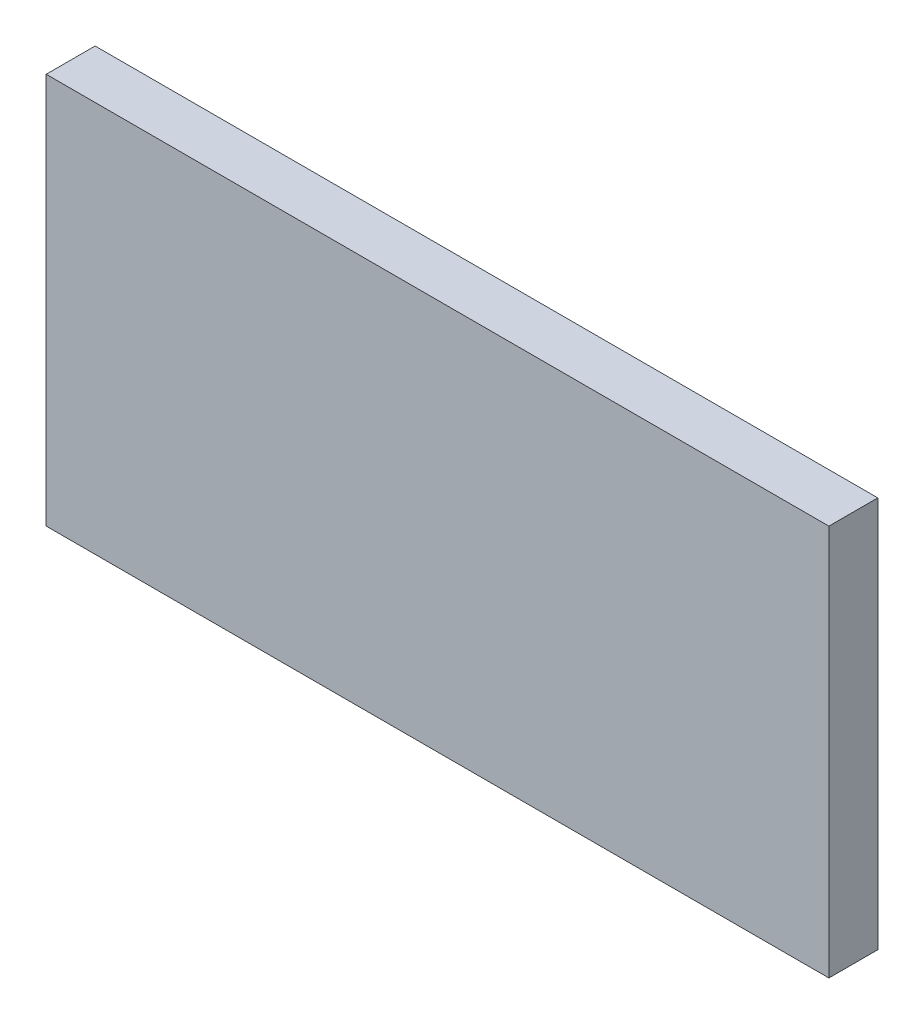
ISO-10303-21;
HEADER;
FILE_DESCRIPTION(('STEP AP214'),'2;1');
FILE_NAME('part.step','',(''),(''),'','','');
FILE_SCHEMA(('AUTOMOTIVE_DESIGN { 1 0 10303 214 1 1 1 1 }'));
ENDSEC;
DATA;
#1=APPLICATION_CONTEXT('core data for automotive mechanical design processes');
#2=APPLICATION_PROTOCOL_DEFINITION('international standard','automotive_design',2000,#1);
#3=PRODUCT_CONTEXT('',#1,'mechanical');
#4=PRODUCT('Part','Part','',(#3));
#5=PRODUCT_RELATED_PRODUCT_CATEGORY('part','',(#4));
#6=PRODUCT_DEFINITION_FORMATION('','',#4);
#7=PRODUCT_DEFINITION_CONTEXT('part definition',#1,'design');
#8=PRODUCT_DEFINITION('design','',#6,#7);
#9=PRODUCT_DEFINITION_SHAPE('','',#8);
#10=(LENGTH_UNIT() NAMED_UNIT(*) SI_UNIT(.MILLI.,.METRE.));
#11=(NAMED_UNIT(*) PLANE_ANGLE_UNIT() SI_UNIT($,.RADIAN.));
#12=(NAMED_UNIT(*) SI_UNIT($,.STERADIAN.) SOLID_ANGLE_UNIT());
#13=UNCERTAINTY_MEASURE_WITH_UNIT(LENGTH_MEASURE(1.E-05),#10,'distance_accuracy_value','');
#14=(GEOMETRIC_REPRESENTATION_CONTEXT(3) GLOBAL_UNCERTAINTY_ASSIGNED_CONTEXT((#13)) GLOBAL_UNIT_ASSIGNED_CONTEXT((#10,
#11,#12)) REPRESENTATION_CONTEXT('',''));
#15=CARTESIAN_POINT('',(0.,0.,0.));
#16=DIRECTION('',(0.,0.,1.));
#17=DIRECTION('',(1.,0.,0.));
#18=AXIS2_PLACEMENT_3D('',#15,#16,#17);
#19=CARTESIAN_POINT('',(-0.8,-0.4,0.1));
#20=DIRECTION('',(0.,0.,-1.));
#21=DIRECTION('',(-1.,0.,0.));
#22=AXIS2_PLACEMENT_3D('',#19,#20,#21);
#23=PLANE('',#22);
#24=DIRECTION('',(0.,1.,0.));
#25=VECTOR('',#24,1.);
#26=CARTESIAN_POINT('',(0.8,-0.4,0.1));
#27=LINE('',#26,#25);
#28=CARTESIAN_POINT('',(0.8,-0.4,0.1));
#29=VERTEX_POINT('',#28);
#30=CARTESIAN_POINT('',(0.8,0.4,0.1));
#31=VERTEX_POINT('',#30);
#32=EDGE_CURVE('E55',#29,#31,#27,.T.);
#33=ORIENTED_EDGE('',*,*,#32,.T.);
#34=DIRECTION('',(1.,0.,0.));
#35=VECTOR('',#34,1.);
#36=CARTESIAN_POINT('',(0.8,0.4,0.1));
#37=LINE('',#36,#35);
#38=CARTESIAN_POINT('',(-0.8,0.4,0.1));
#39=VERTEX_POINT('',#38);
#40=EDGE_CURVE('E57',#31,#39,#37,.F.);
#41=ORIENTED_EDGE('',*,*,#40,.T.);
#42=DIRECTION('',(0.,1.,0.));
#43=VECTOR('',#42,1.);
#44=CARTESIAN_POINT('',(-0.8,0.4,0.1));
#45=LINE('',#44,#43);
#46=CARTESIAN_POINT('',(-0.8,-0.4,0.1));
#47=VERTEX_POINT('',#46);
#48=EDGE_CURVE('E20',#39,#47,#45,.F.);
#49=ORIENTED_EDGE('',*,*,#48,.T.);
#50=DIRECTION('',(1.,0.,0.));
#51=VECTOR('',#50,1.);
#52=CARTESIAN_POINT('',(-0.8,-0.4,0.1));
#53=LINE('',#52,#51);
#54=EDGE_CURVE('E80',#47,#29,#53,.T.);
#55=ORIENTED_EDGE('',*,*,#54,.T.);
#56=EDGE_LOOP('',(#33,#41,#49,#55));
#57=FACE_BOUND('',#56,.T.);
#58=ADVANCED_FACE('F17',(#57),#23,.F.);
#59=CARTESIAN_POINT('',(-0.8,0.4,0.));
#60=DIRECTION('',(1.,0.,0.));
#61=DIRECTION('',(0.,0.,-1.));
#62=AXIS2_PLACEMENT_3D('',#59,#60,#61);
#63=PLANE('',#62);
#64=DIRECTION('',(0.,0.,1.));
#65=VECTOR('',#64,1.);
#66=CARTESIAN_POINT('',(-0.8,-0.4,0.));
#67=LINE('',#66,#65);
#68=CARTESIAN_POINT('',(-0.8,-0.4,0.));
#69=VERTEX_POINT('',#68);
#70=EDGE_CURVE('E68',#69,#47,#67,.T.);
#71=ORIENTED_EDGE('',*,*,#70,.T.);
#72=ORIENTED_EDGE('',*,*,#48,.F.);
#73=DIRECTION('',(0.,0.,-1.));
#74=VECTOR('',#73,1.);
#75=CARTESIAN_POINT('',(-0.8,0.4,0.));
#76=LINE('',#75,#74);
#77=CARTESIAN_POINT('',(-0.8,0.4,0.));
#78=VERTEX_POINT('',#77);
#79=EDGE_CURVE('E63',#39,#78,#76,.T.);
#80=ORIENTED_EDGE('',*,*,#79,.T.);
#81=DIRECTION('',(0.,1.,0.));
#82=VECTOR('',#81,1.);
#83=CARTESIAN_POINT('',(-0.8,-0.4,0.));
#84=LINE('',#83,#82);
#85=EDGE_CURVE('E83',#69,#78,#84,.T.);
#86=ORIENTED_EDGE('',*,*,#85,.F.);
#87=EDGE_LOOP('',(#71,#72,#80,#86));
#88=FACE_BOUND('',#87,.T.);
#89=ADVANCED_FACE('F65',(#88),#63,.F.);
#90=CARTESIAN_POINT('',(0.8,0.4,0.));
#91=DIRECTION('',(0.,-1.,0.));
#92=DIRECTION('',(0.,0.,-1.));
#93=AXIS2_PLACEMENT_3D('',#90,#91,#92);
#94=PLANE('',#93);
#95=ORIENTED_EDGE('',*,*,#79,.F.);
#96=ORIENTED_EDGE('',*,*,#40,.F.);
#97=DIRECTION('',(0.,0.,1.));
#98=VECTOR('',#97,1.);
#99=CARTESIAN_POINT('',(0.8,0.4,0.));
#100=LINE('',#99,#98);
#101=CARTESIAN_POINT('',(0.8,0.4,0.));
#102=VERTEX_POINT('',#101);
#103=EDGE_CURVE('E75',#31,#102,#100,.F.);
#104=ORIENTED_EDGE('',*,*,#103,.T.);
#105=DIRECTION('',(-1.,0.,0.));
#106=VECTOR('',#105,1.);
#107=CARTESIAN_POINT('',(-0.8,0.4,0.));
#108=LINE('',#107,#106);
#109=EDGE_CURVE('E72',#78,#102,#108,.F.);
#110=ORIENTED_EDGE('',*,*,#109,.F.);
#111=EDGE_LOOP('',(#95,#96,#104,#110));
#112=FACE_BOUND('',#111,.T.);
#113=ADVANCED_FACE('F70',(#112),#94,.F.);
#114=CARTESIAN_POINT('',(0.8,-0.4,0.));
#115=DIRECTION('',(-1.,0.,0.));
#116=DIRECTION('',(0.,0.,1.));
#117=AXIS2_PLACEMENT_3D('',#114,#115,#116);
#118=PLANE('',#117);
#119=ORIENTED_EDGE('',*,*,#103,.F.);
#120=ORIENTED_EDGE('',*,*,#32,.F.);
#121=DIRECTION('',(0.,0.,1.));
#122=VECTOR('',#121,1.);
#123=CARTESIAN_POINT('',(0.8,-0.4,0.));
#124=LINE('',#123,#122);
#125=CARTESIAN_POINT('',(0.8,-0.4,0.));
#126=VERTEX_POINT('',#125);
#127=EDGE_CURVE('E35',#29,#126,#124,.F.);
#128=ORIENTED_EDGE('',*,*,#127,.T.);
#129=DIRECTION('',(0.,1.,0.));
#130=VECTOR('',#129,1.);
#131=CARTESIAN_POINT('',(0.8,-0.4,0.));
#132=LINE('',#131,#130);
#133=EDGE_CURVE('E26',#102,#126,#132,.F.);
#134=ORIENTED_EDGE('',*,*,#133,.F.);
#135=EDGE_LOOP('',(#119,#120,#128,#134));
#136=FACE_BOUND('',#135,.T.);
#137=ADVANCED_FACE('F89',(#136),#118,.F.);
#138=CARTESIAN_POINT('',(-0.8,-0.4,0.));
#139=DIRECTION('',(0.,1.,0.));
#140=DIRECTION('',(0.,0.,1.));
#141=AXIS2_PLACEMENT_3D('',#138,#139,#140);
#142=PLANE('',#141);
#143=ORIENTED_EDGE('',*,*,#127,.F.);
#144=ORIENTED_EDGE('',*,*,#54,.F.);
#145=ORIENTED_EDGE('',*,*,#70,.F.);
#146=DIRECTION('',(-1.,0.,0.));
#147=VECTOR('',#146,1.);
#148=CARTESIAN_POINT('',(-0.8,-0.4,0.));
#149=LINE('',#148,#147);
#150=EDGE_CURVE('E11',#126,#69,#149,.T.);
#151=ORIENTED_EDGE('',*,*,#150,.F.);
#152=EDGE_LOOP('',(#143,#144,#145,#151));
#153=FACE_BOUND('',#152,.T.);
#154=ADVANCED_FACE('F91',(#153),#142,.F.);
#155=CARTESIAN_POINT('',(-0.8,-0.4,0.));
#156=DIRECTION('',(0.,0.,-1.));
#157=DIRECTION('',(-1.,0.,0.));
#158=AXIS2_PLACEMENT_3D('',#155,#156,#157);
#159=PLANE('',#158);
#160=ORIENTED_EDGE('',*,*,#133,.T.);
#161=ORIENTED_EDGE('',*,*,#150,.T.);
#162=ORIENTED_EDGE('',*,*,#85,.T.);
#163=ORIENTED_EDGE('',*,*,#109,.T.);
#164=EDGE_LOOP('',(#160,#161,#162,#163));
#165=FACE_BOUND('',#164,.T.);
#166=ADVANCED_FACE('F88',(#165),#159,.T.);
#167=CLOSED_SHELL('',(#58,#89,#113,#137,#154,#166));
#168=MANIFOLD_SOLID_BREP('B1',#167);
#169=ADVANCED_BREP_SHAPE_REPRESENTATION('',(#18,#168),#14);
#170=SHAPE_DEFINITION_REPRESENTATION(#9,#169);
ENDSEC;
END-ISO-10303-21;
